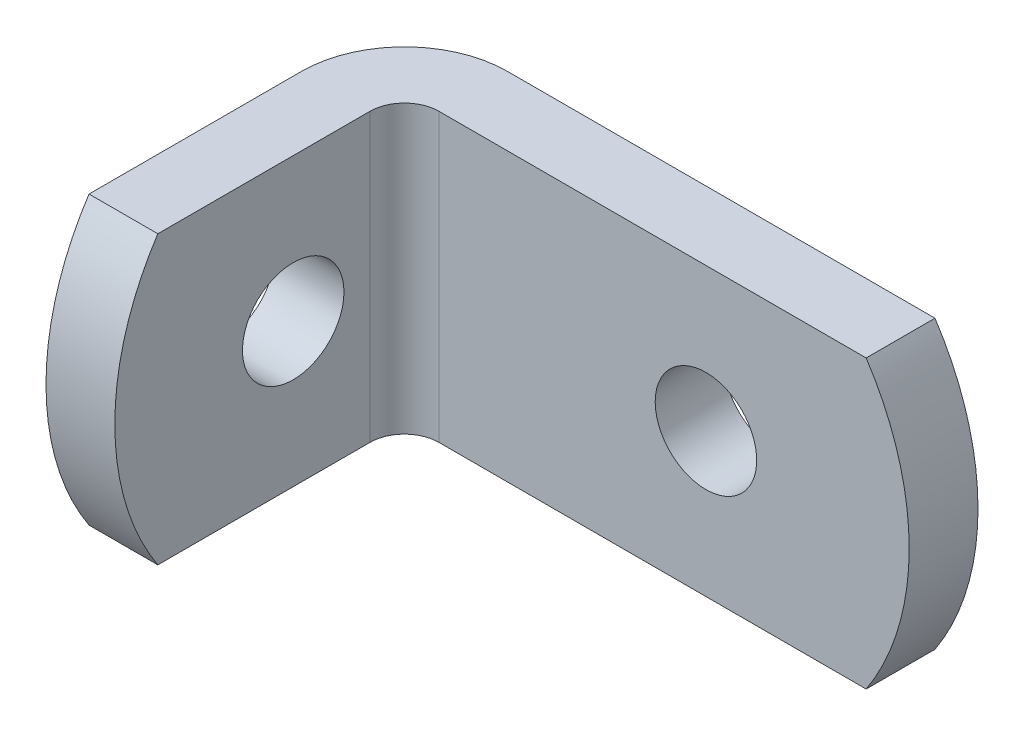
ISO-10303-21;
HEADER;
FILE_DESCRIPTION(('STEP AP214'),'2;1');
FILE_NAME('part.step','',(''),(''),'','','');
FILE_SCHEMA(('AUTOMOTIVE_DESIGN { 1 0 10303 214 1 1 1 1 }'));
ENDSEC;
DATA;
#1=APPLICATION_CONTEXT('core data for automotive mechanical design processes');
#2=APPLICATION_PROTOCOL_DEFINITION('international standard','automotive_design',2000,#1);
#3=PRODUCT_CONTEXT('',#1,'mechanical');
#4=PRODUCT('Part','Part','',(#3));
#5=PRODUCT_RELATED_PRODUCT_CATEGORY('part','',(#4));
#6=PRODUCT_DEFINITION_FORMATION('','',#4);
#7=PRODUCT_DEFINITION_CONTEXT('part definition',#1,'design');
#8=PRODUCT_DEFINITION('design','',#6,#7);
#9=PRODUCT_DEFINITION_SHAPE('','',#8);
#10=(LENGTH_UNIT() NAMED_UNIT(*) SI_UNIT(.MILLI.,.METRE.));
#11=(NAMED_UNIT(*) PLANE_ANGLE_UNIT() SI_UNIT($,.RADIAN.));
#12=(NAMED_UNIT(*) SI_UNIT($,.STERADIAN.) SOLID_ANGLE_UNIT());
#13=UNCERTAINTY_MEASURE_WITH_UNIT(LENGTH_MEASURE(1.E-05),#10,'distance_accuracy_value','');
#14=(GEOMETRIC_REPRESENTATION_CONTEXT(3) GLOBAL_UNCERTAINTY_ASSIGNED_CONTEXT((#13)) GLOBAL_UNIT_ASSIGNED_CONTEXT((#10,
#11,#12)) REPRESENTATION_CONTEXT('',''));
#15=CARTESIAN_POINT('',(0.,0.,0.));
#16=DIRECTION('',(0.,0.,1.));
#17=DIRECTION('',(1.,0.,0.));
#18=AXIS2_PLACEMENT_3D('',#15,#16,#17);
#19=CARTESIAN_POINT('',(4.572,6.35,3.048));
#20=DIRECTION('',(0.,0.,-1.));
#21=DIRECTION('',(-1.,0.,0.));
#22=AXIS2_PLACEMENT_3D('',#19,#20,#21);
#23=PLANE('',#22);
#24=CARTESIAN_POINT('',(16.4,0.,3.048));
#25=DIRECTION('',(0.,0.,-1.));
#26=DIRECTION('',(-1.,0.,0.));
#27=AXIS2_PLACEMENT_3D('',#24,#25,#26);
#28=CIRCLE('',#27,2.2479);
#29=CARTESIAN_POINT('',(14.1521,0.,3.048));
#30=VERTEX_POINT('',#29);
#31=EDGE_CURVE('E185',#30,#30,#28,.F.);
#32=ORIENTED_EDGE('',*,*,#31,.F.);
#33=EDGE_LOOP('',(#32));
#34=FACE_BOUND('',#33,.T.);
#35=CARTESIAN_POINT('',(13.8641666666667,0.,3.048));
#36=DIRECTION('',(0.,0.,-1.));
#37=DIRECTION('',(-1.,0.,0.));
#38=AXIS2_PLACEMENT_3D('',#35,#36,#37);
#39=CIRCLE('',#38,11.5358333333333);
#40=CARTESIAN_POINT('',(23.495,6.35,3.048));
#41=VERTEX_POINT('',#40);
#42=CARTESIAN_POINT('',(23.495,-6.35,3.048));
#43=VERTEX_POINT('',#42);
#44=EDGE_CURVE('E48',#41,#43,#39,.T.);
#45=ORIENTED_EDGE('',*,*,#44,.F.);
#46=DIRECTION('',(1.,0.,0.));
#47=VECTOR('',#46,1.);
#48=CARTESIAN_POINT('',(4.572,6.35,3.048));
#49=LINE('',#48,#47);
#50=CARTESIAN_POINT('',(4.572,6.35,3.048));
#51=VERTEX_POINT('',#50);
#52=EDGE_CURVE('E108',#51,#41,#49,.T.);
#53=ORIENTED_EDGE('',*,*,#52,.F.);
#54=DIRECTION('',(0.,-1.,0.));
#55=VECTOR('',#54,1.);
#56=CARTESIAN_POINT('',(4.572,6.35,3.048));
#57=LINE('',#56,#55);
#58=CARTESIAN_POINT('',(4.572,-6.35,3.048));
#59=VERTEX_POINT('',#58);
#60=EDGE_CURVE('E134',#51,#59,#57,.T.);
#61=ORIENTED_EDGE('',*,*,#60,.T.);
#62=DIRECTION('',(1.,0.,0.));
#63=VECTOR('',#62,1.);
#64=CARTESIAN_POINT('',(4.572,-6.35,3.048));
#65=LINE('',#64,#63);
#66=EDGE_CURVE('E110',#59,#43,#65,.T.);
#67=ORIENTED_EDGE('',*,*,#66,.T.);
#68=EDGE_LOOP('',(#45,#53,#61,#67));
#69=FACE_BOUND('',#68,.T.);
#70=ADVANCED_FACE('F34',(#34,#69),#23,.F.);
#71=CARTESIAN_POINT('',(4.572,6.35,0.));
#72=DIRECTION('',(0.,0.,-1.));
#73=DIRECTION('',(-1.,0.,0.));
#74=AXIS2_PLACEMENT_3D('',#71,#72,#73);
#75=PLANE('',#74);
#76=CARTESIAN_POINT('',(16.4,0.,0.));
#77=DIRECTION('',(0.,0.,1.));
#78=DIRECTION('',(1.,0.,0.));
#79=AXIS2_PLACEMENT_3D('',#76,#77,#78);
#80=CIRCLE('',#79,2.2479);
#81=CARTESIAN_POINT('',(18.6479,0.,0.));
#82=VERTEX_POINT('',#81);
#83=EDGE_CURVE('E182',#82,#82,#80,.T.);
#84=ORIENTED_EDGE('',*,*,#83,.T.);
#85=EDGE_LOOP('',(#84));
#86=FACE_BOUND('',#85,.T.);
#87=DIRECTION('',(1.,0.,0.));
#88=VECTOR('',#87,1.);
#89=CARTESIAN_POINT('',(4.572,6.35,0.));
#90=LINE('',#89,#88);
#91=CARTESIAN_POINT('',(4.572,6.35,0.));
#92=VERTEX_POINT('',#91);
#93=CARTESIAN_POINT('',(23.495,6.35,0.));
#94=VERTEX_POINT('',#93);
#95=EDGE_CURVE('E116',#92,#94,#90,.T.);
#96=ORIENTED_EDGE('',*,*,#95,.T.);
#97=CARTESIAN_POINT('',(13.8641666666667,0.,0.));
#98=DIRECTION('',(0.,0.,-1.));
#99=DIRECTION('',(-1.,0.,0.));
#100=AXIS2_PLACEMENT_3D('',#97,#98,#99);
#101=CIRCLE('',#100,11.5358333333333);
#102=CARTESIAN_POINT('',(23.495,-6.35,0.));
#103=VERTEX_POINT('',#102);
#104=EDGE_CURVE('E99',#94,#103,#101,.T.);
#105=ORIENTED_EDGE('',*,*,#104,.T.);
#106=DIRECTION('',(1.,0.,0.));
#107=VECTOR('',#106,1.);
#108=CARTESIAN_POINT('',(4.572,-6.35,0.));
#109=LINE('',#108,#107);
#110=CARTESIAN_POINT('',(4.572,-6.35,0.));
#111=VERTEX_POINT('',#110);
#112=EDGE_CURVE('E136',#111,#103,#109,.T.);
#113=ORIENTED_EDGE('',*,*,#112,.F.);
#114=DIRECTION('',(0.,-1.,0.));
#115=VECTOR('',#114,1.);
#116=CARTESIAN_POINT('',(4.572,6.35,0.));
#117=LINE('',#116,#115);
#118=EDGE_CURVE('E153',#92,#111,#117,.T.);
#119=ORIENTED_EDGE('',*,*,#118,.F.);
#120=EDGE_LOOP('',(#96,#105,#113,#119));
#121=FACE_BOUND('',#120,.T.);
#122=ADVANCED_FACE('F176',(#86,#121),#75,.T.);
#123=CARTESIAN_POINT('',(4.572,6.35,4.572));
#124=DIRECTION('',(0.,-1.,0.));
#125=DIRECTION('',(-1.,0.,0.));
#126=AXIS2_PLACEMENT_3D('',#123,#124,#125);
#127=PLANE('',#126);
#128=DIRECTION('',(0.,0.,-1.));
#129=VECTOR('',#128,1.);
#130=CARTESIAN_POINT('',(23.495,6.35,44.4775858524022));
#131=LINE('',#130,#129);
#132=EDGE_CURVE('E97',#41,#94,#131,.T.);
#133=ORIENTED_EDGE('',*,*,#132,.T.);
#134=ORIENTED_EDGE('',*,*,#95,.F.);
#135=CARTESIAN_POINT('',(4.572,6.35,4.572));
#136=DIRECTION('',(0.,-1.,0.));
#137=DIRECTION('',(0.,0.,1.));
#138=AXIS2_PLACEMENT_3D('',#135,#136,#137);
#139=CIRCLE('',#138,4.572);
#140=CARTESIAN_POINT('',(0.,6.35,4.572));
#141=VERTEX_POINT('',#140);
#142=EDGE_CURVE('E119',#141,#92,#139,.T.);
#143=ORIENTED_EDGE('',*,*,#142,.F.);
#144=DIRECTION('',(0.,0.,-1.));
#145=VECTOR('',#144,1.);
#146=CARTESIAN_POINT('',(0.,6.35,15.875));
#147=LINE('',#146,#145);
#148=CARTESIAN_POINT('',(0.,6.35,13.97));
#149=VERTEX_POINT('',#148);
#150=EDGE_CURVE('E129',#149,#141,#147,.T.);
#151=ORIENTED_EDGE('',*,*,#150,.F.);
#152=DIRECTION('',(-1.,0.,0.));
#153=VECTOR('',#152,1.);
#154=CARTESIAN_POINT('',(71.6555858524021,6.35,13.97));
#155=LINE('',#154,#153);
#156=CARTESIAN_POINT('',(3.048,6.35,13.97));
#157=VERTEX_POINT('',#156);
#158=EDGE_CURVE('E55',#157,#149,#155,.T.);
#159=ORIENTED_EDGE('',*,*,#158,.F.);
#160=DIRECTION('',(0.,0.,-1.));
#161=VECTOR('',#160,1.);
#162=CARTESIAN_POINT('',(3.048,6.35,15.875));
#163=LINE('',#162,#161);
#164=CARTESIAN_POINT('',(3.048,6.35,4.572));
#165=VERTEX_POINT('',#164);
#166=EDGE_CURVE('E131',#157,#165,#163,.T.);
#167=ORIENTED_EDGE('',*,*,#166,.T.);
#168=CARTESIAN_POINT('',(4.572,6.35,4.572));
#169=DIRECTION('',(0.,1.,0.));
#170=DIRECTION('',(1.,0.,0.));
#171=AXIS2_PLACEMENT_3D('',#168,#169,#170);
#172=CIRCLE('',#171,1.524);
#173=EDGE_CURVE('E114',#165,#51,#172,.F.);
#174=ORIENTED_EDGE('',*,*,#173,.T.);
#175=ORIENTED_EDGE('',*,*,#52,.T.);
#176=EDGE_LOOP('',(#133,#134,#143,#151,#159,#167,#174,#175));
#177=FACE_BOUND('',#176,.T.);
#178=ADVANCED_FACE('F112',(#177),#127,.F.);
#179=CARTESIAN_POINT('',(4.572,-6.35,4.572));
#180=DIRECTION('',(0.,-1.,0.));
#181=DIRECTION('',(-1.,0.,0.));
#182=AXIS2_PLACEMENT_3D('',#179,#180,#181);
#183=PLANE('',#182);
#184=ORIENTED_EDGE('',*,*,#112,.T.);
#185=DIRECTION('',(0.,0.,-1.));
#186=VECTOR('',#185,1.);
#187=CARTESIAN_POINT('',(23.495,-6.35,44.4775858524022));
#188=LINE('',#187,#186);
#189=EDGE_CURVE('E11',#103,#43,#188,.F.);
#190=ORIENTED_EDGE('',*,*,#189,.T.);
#191=ORIENTED_EDGE('',*,*,#66,.F.);
#192=CARTESIAN_POINT('',(4.572,-6.35,4.572));
#193=DIRECTION('',(0.,1.,0.));
#194=DIRECTION('',(1.,0.,0.));
#195=AXIS2_PLACEMENT_3D('',#192,#193,#194);
#196=CIRCLE('',#195,1.524);
#197=CARTESIAN_POINT('',(3.048,-6.35,4.572));
#198=VERTEX_POINT('',#197);
#199=EDGE_CURVE('E117',#198,#59,#196,.F.);
#200=ORIENTED_EDGE('',*,*,#199,.F.);
#201=DIRECTION('',(0.,0.,-1.));
#202=VECTOR('',#201,1.);
#203=CARTESIAN_POINT('',(3.048,-6.35,15.875));
#204=LINE('',#203,#202);
#205=CARTESIAN_POINT('',(3.048,-6.35,13.97));
#206=VERTEX_POINT('',#205);
#207=EDGE_CURVE('E121',#206,#198,#204,.T.);
#208=ORIENTED_EDGE('',*,*,#207,.F.);
#209=DIRECTION('',(-1.,0.,0.));
#210=VECTOR('',#209,1.);
#211=CARTESIAN_POINT('',(71.6555858524021,-6.35,13.97));
#212=LINE('',#211,#210);
#213=CARTESIAN_POINT('',(0.,-6.35,13.97));
#214=VERTEX_POINT('',#213);
#215=EDGE_CURVE('E41',#214,#206,#212,.F.);
#216=ORIENTED_EDGE('',*,*,#215,.F.);
#217=DIRECTION('',(0.,0.,-1.));
#218=VECTOR('',#217,1.);
#219=CARTESIAN_POINT('',(0.,-6.35,15.875));
#220=LINE('',#219,#218);
#221=CARTESIAN_POINT('',(0.,-6.35,4.572));
#222=VERTEX_POINT('',#221);
#223=EDGE_CURVE('E143',#214,#222,#220,.T.);
#224=ORIENTED_EDGE('',*,*,#223,.T.);
#225=CARTESIAN_POINT('',(4.572,-6.35,4.572));
#226=DIRECTION('',(0.,-1.,0.));
#227=DIRECTION('',(0.,0.,1.));
#228=AXIS2_PLACEMENT_3D('',#225,#226,#227);
#229=CIRCLE('',#228,4.572);
#230=EDGE_CURVE('E140',#222,#111,#229,.T.);
#231=ORIENTED_EDGE('',*,*,#230,.T.);
#232=EDGE_LOOP('',(#184,#190,#191,#200,#208,#216,#224,#231));
#233=FACE_BOUND('',#232,.T.);
#234=ADVANCED_FACE('F164',(#233),#183,.T.);
#235=CARTESIAN_POINT('',(4.572,6.35,4.572));
#236=DIRECTION('',(0.,-1.,0.));
#237=DIRECTION('',(0.,0.,-1.));
#238=AXIS2_PLACEMENT_3D('',#235,#236,#237);
#239=CYLINDRICAL_SURFACE('',#238,4.572);
#240=ORIENTED_EDGE('',*,*,#230,.F.);
#241=DIRECTION('',(0.,-1.,0.));
#242=VECTOR('',#241,1.);
#243=CARTESIAN_POINT('',(0.,6.35,4.572));
#244=LINE('',#243,#242);
#245=EDGE_CURVE('E150',#141,#222,#244,.T.);
#246=ORIENTED_EDGE('',*,*,#245,.F.);
#247=ORIENTED_EDGE('',*,*,#142,.T.);
#248=ORIENTED_EDGE('',*,*,#118,.T.);
#249=EDGE_LOOP('',(#240,#246,#247,#248));
#250=FACE_BOUND('',#249,.T.);
#251=ADVANCED_FACE('F173',(#250),#239,.T.);
#252=CARTESIAN_POINT('',(0.,6.35,15.875));
#253=DIRECTION('',(-1.,0.,0.));
#254=DIRECTION('',(0.,0.,1.));
#255=AXIS2_PLACEMENT_3D('',#252,#253,#254);
#256=PLANE('',#255);
#257=CARTESIAN_POINT('',(0.,0.,4.33916666666667));
#258=DIRECTION('',(-1.,0.,0.));
#259=DIRECTION('',(0.,0.,1.));
#260=AXIS2_PLACEMENT_3D('',#257,#258,#259);
#261=CIRCLE('',#260,11.5358333333333);
#262=EDGE_CURVE('E160',#149,#214,#261,.F.);
#263=ORIENTED_EDGE('',*,*,#262,.F.);
#264=ORIENTED_EDGE('',*,*,#150,.T.);
#265=ORIENTED_EDGE('',*,*,#245,.T.);
#266=ORIENTED_EDGE('',*,*,#223,.F.);
#267=EDGE_LOOP('',(#263,#264,#265,#266));
#268=FACE_BOUND('',#267,.T.);
#269=CARTESIAN_POINT('',(0.,0.,7.975));
#270=DIRECTION('',(1.,0.,0.));
#271=DIRECTION('',(0.,0.,-1.));
#272=AXIS2_PLACEMENT_3D('',#269,#270,#271);
#273=CIRCLE('',#272,2.2479);
#274=CARTESIAN_POINT('',(0.,0.,5.7271));
#275=VERTEX_POINT('',#274);
#276=EDGE_CURVE('E137',#275,#275,#273,.T.);
#277=ORIENTED_EDGE('',*,*,#276,.T.);
#278=EDGE_LOOP('',(#277));
#279=FACE_BOUND('',#278,.T.);
#280=ADVANCED_FACE('F167',(#268,#279),#256,.T.);
#281=CARTESIAN_POINT('',(3.048,6.35,15.875));
#282=DIRECTION('',(-1.,0.,0.));
#283=DIRECTION('',(0.,0.,1.));
#284=AXIS2_PLACEMENT_3D('',#281,#282,#283);
#285=PLANE('',#284);
#286=CARTESIAN_POINT('',(3.048,0.,7.975));
#287=DIRECTION('',(1.,0.,0.));
#288=DIRECTION('',(0.,0.,-1.));
#289=AXIS2_PLACEMENT_3D('',#286,#287,#288);
#290=CIRCLE('',#289,2.2479);
#291=CARTESIAN_POINT('',(3.048,0.,5.7271));
#292=VERTEX_POINT('',#291);
#293=EDGE_CURVE('E124',#292,#292,#290,.T.);
#294=ORIENTED_EDGE('',*,*,#293,.F.);
#295=EDGE_LOOP('',(#294));
#296=FACE_BOUND('',#295,.T.);
#297=CARTESIAN_POINT('',(3.048,0.,4.33916666666667));
#298=DIRECTION('',(-1.,0.,0.));
#299=DIRECTION('',(0.,0.,1.));
#300=AXIS2_PLACEMENT_3D('',#297,#298,#299);
#301=CIRCLE('',#300,11.5358333333333);
#302=EDGE_CURVE('E159',#157,#206,#301,.F.);
#303=ORIENTED_EDGE('',*,*,#302,.T.);
#304=ORIENTED_EDGE('',*,*,#207,.T.);
#305=DIRECTION('',(0.,-1.,0.));
#306=VECTOR('',#305,1.);
#307=CARTESIAN_POINT('',(3.048,6.35,4.572));
#308=LINE('',#307,#306);
#309=EDGE_CURVE('E147',#165,#198,#308,.T.);
#310=ORIENTED_EDGE('',*,*,#309,.F.);
#311=ORIENTED_EDGE('',*,*,#166,.F.);
#312=EDGE_LOOP('',(#303,#304,#310,#311));
#313=FACE_BOUND('',#312,.T.);
#314=ADVANCED_FACE('F194',(#296,#313),#285,.F.);
#315=CARTESIAN_POINT('',(4.572,6.35,4.572));
#316=DIRECTION('',(0.,-1.,0.));
#317=DIRECTION('',(0.,0.,-1.));
#318=AXIS2_PLACEMENT_3D('',#315,#316,#317);
#319=CYLINDRICAL_SURFACE('',#318,1.524);
#320=ORIENTED_EDGE('',*,*,#199,.T.);
#321=ORIENTED_EDGE('',*,*,#60,.F.);
#322=ORIENTED_EDGE('',*,*,#173,.F.);
#323=ORIENTED_EDGE('',*,*,#309,.T.);
#324=EDGE_LOOP('',(#320,#321,#322,#323));
#325=FACE_BOUND('',#324,.T.);
#326=ADVANCED_FACE('F197',(#325),#319,.F.);
#327=CARTESIAN_POINT('',(0.,0.,7.975));
#328=DIRECTION('',(1.,0.,0.));
#329=DIRECTION('',(0.,0.,-1.));
#330=AXIS2_PLACEMENT_3D('',#327,#328,#329);
#331=CYLINDRICAL_SURFACE('',#330,2.2479);
#332=CARTESIAN_POINT('',(0.,0.,5.7271));
#333=CARTESIAN_POINT('',(0.0317499999999997,0.,5.7271));
#334=CARTESIAN_POINT('',(0.0634999999999997,0.,5.7271));
#335=CARTESIAN_POINT('',(0.127,0.,5.7271));
#336=CARTESIAN_POINT('',(0.15875,0.,5.7271));
#337=CARTESIAN_POINT('',(0.22225,0.,5.7271));
#338=CARTESIAN_POINT('',(0.254,0.,5.7271));
#339=CARTESIAN_POINT('',(0.3175,0.,5.7271));
#340=CARTESIAN_POINT('',(0.34925,0.,5.7271));
#341=CARTESIAN_POINT('',(0.41275,0.,5.7271));
#342=CARTESIAN_POINT('',(0.4445,0.,5.7271));
#343=CARTESIAN_POINT('',(0.508,0.,5.7271));
#344=CARTESIAN_POINT('',(0.53975,0.,5.7271));
#345=CARTESIAN_POINT('',(0.60325,0.,5.7271));
#346=CARTESIAN_POINT('',(0.635,0.,5.7271));
#347=CARTESIAN_POINT('',(0.6985,0.,5.7271));
#348=CARTESIAN_POINT('',(0.73025,0.,5.7271));
#349=CARTESIAN_POINT('',(0.79375,0.,5.7271));
#350=CARTESIAN_POINT('',(0.8255,0.,5.7271));
#351=CARTESIAN_POINT('',(0.889,0.,5.7271));
#352=CARTESIAN_POINT('',(0.92075,0.,5.7271));
#353=CARTESIAN_POINT('',(0.98425,0.,5.7271));
#354=CARTESIAN_POINT('',(1.016,0.,5.7271));
#355=CARTESIAN_POINT('',(1.0795,0.,5.7271));
#356=CARTESIAN_POINT('',(1.11125,0.,5.7271));
#357=CARTESIAN_POINT('',(1.17475,0.,5.7271));
#358=CARTESIAN_POINT('',(1.2065,0.,5.7271));
#359=CARTESIAN_POINT('',(1.27,0.,5.7271));
#360=CARTESIAN_POINT('',(1.30175,0.,5.7271));
#361=CARTESIAN_POINT('',(1.36525,0.,5.7271));
#362=CARTESIAN_POINT('',(1.397,0.,5.7271));
#363=CARTESIAN_POINT('',(1.4605,0.,5.7271));
#364=CARTESIAN_POINT('',(1.49225,0.,5.7271));
#365=CARTESIAN_POINT('',(1.55575,0.,5.7271));
#366=CARTESIAN_POINT('',(1.5875,0.,5.7271));
#367=CARTESIAN_POINT('',(1.651,0.,5.7271));
#368=CARTESIAN_POINT('',(1.68275,0.,5.7271));
#369=CARTESIAN_POINT('',(1.74625,0.,5.7271));
#370=CARTESIAN_POINT('',(1.778,0.,5.7271));
#371=CARTESIAN_POINT('',(1.8415,0.,5.7271));
#372=CARTESIAN_POINT('',(1.87325,0.,5.7271));
#373=CARTESIAN_POINT('',(1.93675,0.,5.7271));
#374=CARTESIAN_POINT('',(1.9685,0.,5.7271));
#375=CARTESIAN_POINT('',(2.032,0.,5.7271));
#376=CARTESIAN_POINT('',(2.06375,0.,5.7271));
#377=CARTESIAN_POINT('',(2.12725,0.,5.7271));
#378=CARTESIAN_POINT('',(2.159,0.,5.7271));
#379=CARTESIAN_POINT('',(2.2225,0.,5.7271));
#380=CARTESIAN_POINT('',(2.25425,0.,5.7271));
#381=CARTESIAN_POINT('',(2.31775,0.,5.7271));
#382=CARTESIAN_POINT('',(2.3495,0.,5.7271));
#383=CARTESIAN_POINT('',(2.413,0.,5.7271));
#384=CARTESIAN_POINT('',(2.44475,0.,5.7271));
#385=CARTESIAN_POINT('',(2.50825,0.,5.7271));
#386=CARTESIAN_POINT('',(2.54,0.,5.7271));
#387=CARTESIAN_POINT('',(2.6035,0.,5.7271));
#388=CARTESIAN_POINT('',(2.63525,0.,5.7271));
#389=CARTESIAN_POINT('',(2.69875,0.,5.7271));
#390=CARTESIAN_POINT('',(2.7305,0.,5.7271));
#391=CARTESIAN_POINT('',(2.794,0.,5.7271));
#392=CARTESIAN_POINT('',(2.82575,0.,5.7271));
#393=CARTESIAN_POINT('',(2.88925,0.,5.7271));
#394=CARTESIAN_POINT('',(2.921,0.,5.7271));
#395=CARTESIAN_POINT('',(2.9845,0.,5.7271));
#396=CARTESIAN_POINT('',(3.01625,0.,5.7271));
#397=CARTESIAN_POINT('',(3.048,0.,5.7271));
#398=B_SPLINE_CURVE_WITH_KNOTS('',3,(#332,#333,#334,#335,#336,#337,#338,#339,#340,#341,#342,
#343,#344,#345,#346,#347,#348,#349,#350,#351,#352,#353,#354,#355,#356,#357,#358,#359,#360,#361,
#362,#363,#364,#365,#366,#367,#368,#369,#370,#371,#372,#373,#374,#375,#376,#377,#378,#379,#380,
#381,#382,#383,#384,#385,#386,#387,#388,#389,#390,#391,#392,#393,#394,#395,#396,#397),
.UNSPECIFIED.,.F.,.F.,(4,2,2,2,2,2,2,2,2,2,2,2,2,2,2,2,2,2,2,2,2,2,2,2,2,2,2,2,2,2,2,2,4),(0.,
0.09525,0.1905,0.28575,0.381,0.47625,0.5715,0.66675,0.762,0.85725,0.9525,1.04775,1.143,1.23825,
1.3335,1.42875,1.524,1.61925,1.7145,1.80975,1.905,2.00025,2.0955,2.19075,2.286,2.38125,2.4765,
2.57175,2.667,2.76225,2.8575,2.95275,3.048),.UNSPECIFIED.);
#399=EDGE_CURVE('BSEAM192',#275,#292,#398,.T.);
#400=ORIENTED_EDGE('',*,*,#276,.F.);
#401=ORIENTED_EDGE('',*,*,#293,.T.);
#402=ORIENTED_EDGE('',*,*,#399,.T.);
#403=ORIENTED_EDGE('',*,*,#399,.F.);
#404=EDGE_LOOP('',(#400,#402,#401,#403));
#405=FACE_BOUND('',#404,.T.);
#406=ADVANCED_FACE('F192',(#405),#331,.F.);
#407=CARTESIAN_POINT('',(16.4,0.,15.875));
#408=DIRECTION('',(0.,0.,-1.));
#409=DIRECTION('',(-1.,0.,0.));
#410=AXIS2_PLACEMENT_3D('',#407,#408,#409);
#411=CYLINDRICAL_SURFACE('',#410,2.2479);
#412=ORIENTED_EDGE('',*,*,#83,.F.);
#413=EDGE_LOOP('',(#412));
#414=FACE_BOUND('',#413,.T.);
#415=ORIENTED_EDGE('',*,*,#31,.T.);
#416=EDGE_LOOP('',(#415));
#417=FACE_BOUND('',#416,.T.);
#418=ADVANCED_FACE('F206',(#414,#417),#411,.F.);
#419=CARTESIAN_POINT('',(71.6555858524021,0.,4.33916666666667));
#420=DIRECTION('',(-1.,0.,0.));
#421=DIRECTION('',(0.,0.,1.));
#422=AXIS2_PLACEMENT_3D('',#419,#420,#421);
#423=CYLINDRICAL_SURFACE('',#422,11.5358333333333);
#424=ORIENTED_EDGE('',*,*,#215,.T.);
#425=ORIENTED_EDGE('',*,*,#302,.F.);
#426=ORIENTED_EDGE('',*,*,#158,.T.);
#427=ORIENTED_EDGE('',*,*,#262,.T.);
#428=EDGE_LOOP('',(#424,#425,#426,#427));
#429=FACE_BOUND('',#428,.T.);
#430=ADVANCED_FACE('F158',(#429),#423,.T.);
#431=CARTESIAN_POINT('',(13.8641666666667,0.,44.4775858524022));
#432=DIRECTION('',(0.,0.,-1.));
#433=DIRECTION('',(-1.,0.,0.));
#434=AXIS2_PLACEMENT_3D('',#431,#432,#433);
#435=CYLINDRICAL_SURFACE('',#434,11.5358333333333);
#436=ORIENTED_EDGE('',*,*,#132,.F.);
#437=ORIENTED_EDGE('',*,*,#44,.T.);
#438=ORIENTED_EDGE('',*,*,#189,.F.);
#439=ORIENTED_EDGE('',*,*,#104,.F.);
#440=EDGE_LOOP('',(#436,#437,#438,#439));
#441=FACE_BOUND('',#440,.T.);
#442=ADVANCED_FACE('F98',(#441),#435,.T.);
#443=CLOSED_SHELL('',(#70,#122,#178,#234,#251,#280,#314,#326,#406,#418,#430,#442));
#444=MANIFOLD_SOLID_BREP('B2',#443);
#445=ADVANCED_BREP_SHAPE_REPRESENTATION('',(#18,#444),#14);
#446=SHAPE_DEFINITION_REPRESENTATION(#9,#445);
ENDSEC;
END-ISO-10303-21;
